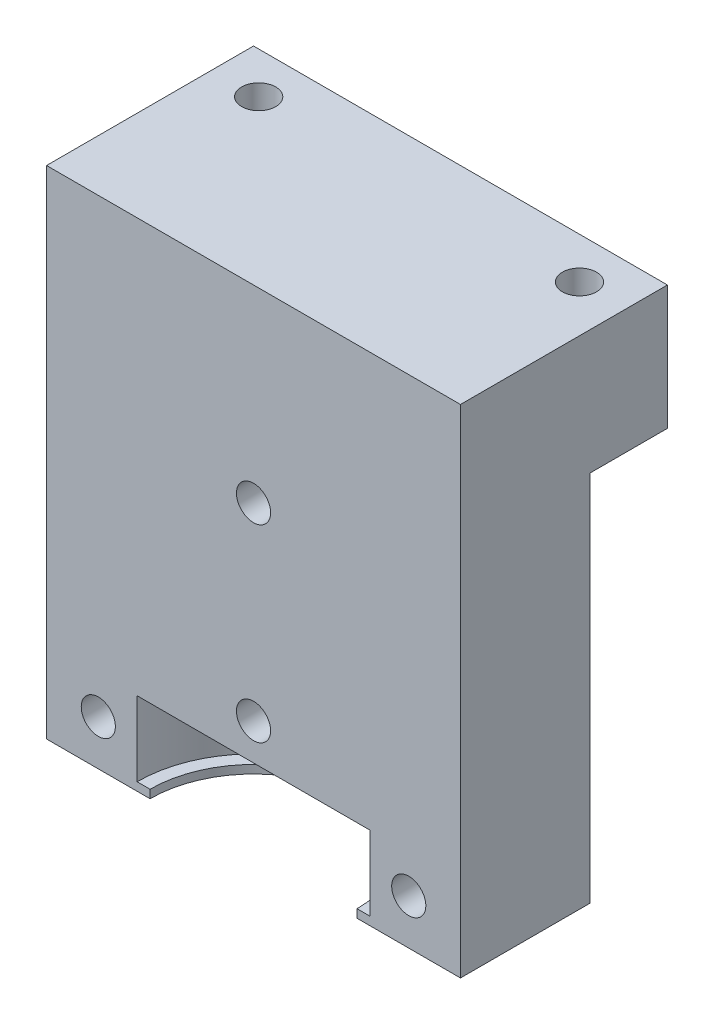
ISO-10303-21;
HEADER;
FILE_DESCRIPTION(('STEP AP214'),'2;1');
FILE_NAME('part.step','',(''),(''),'','','');
FILE_SCHEMA(('AUTOMOTIVE_DESIGN { 1 0 10303 214 1 1 1 1 }'));
ENDSEC;
DATA;
#1=APPLICATION_CONTEXT('core data for automotive mechanical design processes');
#2=APPLICATION_PROTOCOL_DEFINITION('international standard','automotive_design',2000,#1);
#3=PRODUCT_CONTEXT('',#1,'mechanical');
#4=PRODUCT('Part','Part','',(#3));
#5=PRODUCT_RELATED_PRODUCT_CATEGORY('part','',(#4));
#6=PRODUCT_DEFINITION_FORMATION('','',#4);
#7=PRODUCT_DEFINITION_CONTEXT('part definition',#1,'design');
#8=PRODUCT_DEFINITION('design','',#6,#7);
#9=PRODUCT_DEFINITION_SHAPE('','',#8);
#10=(LENGTH_UNIT() NAMED_UNIT(*) SI_UNIT(.MILLI.,.METRE.));
#11=(NAMED_UNIT(*) PLANE_ANGLE_UNIT() SI_UNIT($,.RADIAN.));
#12=(NAMED_UNIT(*) SI_UNIT($,.STERADIAN.) SOLID_ANGLE_UNIT());
#13=UNCERTAINTY_MEASURE_WITH_UNIT(LENGTH_MEASURE(1.E-05),#10,'distance_accuracy_value','');
#14=(GEOMETRIC_REPRESENTATION_CONTEXT(3) GLOBAL_UNCERTAINTY_ASSIGNED_CONTEXT((#13)) GLOBAL_UNIT_ASSIGNED_CONTEXT((#10,
#11,#12)) REPRESENTATION_CONTEXT('',''));
#15=CARTESIAN_POINT('',(0.,0.,0.));
#16=DIRECTION('',(0.,0.,1.));
#17=DIRECTION('',(1.,0.,0.));
#18=AXIS2_PLACEMENT_3D('',#15,#16,#17);
#19=CARTESIAN_POINT('',(20.,-48.,-20.));
#20=DIRECTION('',(0.,0.,-1.));
#21=DIRECTION('',(-1.,0.,0.));
#22=AXIS2_PLACEMENT_3D('',#19,#20,#21);
#23=PLANE('',#22);
#24=DIRECTION('',(0.,1.,0.));
#25=VECTOR('',#24,1.);
#26=CARTESIAN_POINT('',(20.,-48.,-20.));
#27=LINE('',#26,#25);
#28=CARTESIAN_POINT('',(20.,-12.,-20.));
#29=VERTEX_POINT('',#28);
#30=CARTESIAN_POINT('',(20.,0.,-20.));
#31=VERTEX_POINT('',#30);
#32=EDGE_CURVE('E132',#29,#31,#27,.T.);
#33=ORIENTED_EDGE('',*,*,#32,.F.);
#34=DIRECTION('',(1.,0.,0.));
#35=VECTOR('',#34,1.);
#36=CARTESIAN_POINT('',(-20.,-12.,-20.));
#37=LINE('',#36,#35);
#38=CARTESIAN_POINT('',(-20.,-12.,-20.));
#39=VERTEX_POINT('',#38);
#40=EDGE_CURVE('E119',#39,#29,#37,.T.);
#41=ORIENTED_EDGE('',*,*,#40,.F.);
#42=DIRECTION('',(0.,1.,0.));
#43=VECTOR('',#42,1.);
#44=CARTESIAN_POINT('',(-20.,-48.,-20.));
#45=LINE('',#44,#43);
#46=CARTESIAN_POINT('',(-20.,0.,-20.));
#47=VERTEX_POINT('',#46);
#48=EDGE_CURVE('E130',#39,#47,#45,.T.);
#49=ORIENTED_EDGE('',*,*,#48,.T.);
#50=DIRECTION('',(-1.,0.,0.));
#51=VECTOR('',#50,1.);
#52=CARTESIAN_POINT('',(20.,0.,-20.));
#53=LINE('',#52,#51);
#54=EDGE_CURVE('E146',#31,#47,#53,.T.);
#55=ORIENTED_EDGE('',*,*,#54,.F.);
#56=EDGE_LOOP('',(#33,#41,#49,#55));
#57=FACE_BOUND('',#56,.T.);
#58=ADVANCED_FACE('F35',(#57),#23,.T.);
#59=CARTESIAN_POINT('',(15.5,0.,-16.));
#60=DIRECTION('',(0.,1.,0.));
#61=DIRECTION('',(0.,0.,1.));
#62=AXIS2_PLACEMENT_3D('',#59,#60,#61);
#63=CYLINDRICAL_SURFACE('',#62,1.64999999999999);
#64=CARTESIAN_POINT('',(15.5,0.,-16.));
#65=DIRECTION('',(0.,1.,0.));
#66=DIRECTION('',(0.,0.,1.));
#67=AXIS2_PLACEMENT_3D('',#64,#65,#66);
#68=CIRCLE('',#67,1.64999999999999);
#69=CARTESIAN_POINT('',(15.5,0.,-14.35));
#70=VERTEX_POINT('',#69);
#71=EDGE_CURVE('E213',#70,#70,#68,.T.);
#72=ORIENTED_EDGE('',*,*,#71,.T.);
#73=EDGE_LOOP('',(#72));
#74=FACE_BOUND('',#73,.T.);
#75=CARTESIAN_POINT('',(15.5,-12.,-16.));
#76=DIRECTION('',(0.,-1.,0.));
#77=DIRECTION('',(0.,0.,-1.));
#78=AXIS2_PLACEMENT_3D('',#75,#76,#77);
#79=CIRCLE('',#78,1.64999999999999);
#80=CARTESIAN_POINT('',(15.5,-12.,-17.65));
#81=VERTEX_POINT('',#80);
#82=EDGE_CURVE('E172',#81,#81,#79,.F.);
#83=ORIENTED_EDGE('',*,*,#82,.F.);
#84=EDGE_LOOP('',(#83));
#85=FACE_BOUND('',#84,.T.);
#86=ADVANCED_FACE('F266',(#74,#85),#63,.F.);
#87=CARTESIAN_POINT('',(-15.5,0.,-16.));
#88=DIRECTION('',(0.,1.,0.));
#89=DIRECTION('',(0.,0.,1.));
#90=AXIS2_PLACEMENT_3D('',#87,#88,#89);
#91=CYLINDRICAL_SURFACE('',#90,1.64999999999999);
#92=CARTESIAN_POINT('',(-15.5,0.,-16.));
#93=DIRECTION('',(0.,1.,0.));
#94=DIRECTION('',(0.,0.,1.));
#95=AXIS2_PLACEMENT_3D('',#92,#93,#94);
#96=CIRCLE('',#95,1.64999999999999);
#97=CARTESIAN_POINT('',(-15.5,0.,-14.35));
#98=VERTEX_POINT('',#97);
#99=EDGE_CURVE('E209',#98,#98,#96,.T.);
#100=ORIENTED_EDGE('',*,*,#99,.T.);
#101=EDGE_LOOP('',(#100));
#102=FACE_BOUND('',#101,.T.);
#103=CARTESIAN_POINT('',(-15.5,-12.,-16.));
#104=DIRECTION('',(0.,-1.,0.));
#105=DIRECTION('',(0.,0.,-1.));
#106=AXIS2_PLACEMENT_3D('',#103,#104,#105);
#107=CIRCLE('',#106,1.64999999999999);
#108=CARTESIAN_POINT('',(-15.5,-12.,-17.65));
#109=VERTEX_POINT('',#108);
#110=EDGE_CURVE('E39',#109,#109,#107,.F.);
#111=ORIENTED_EDGE('',*,*,#110,.F.);
#112=EDGE_LOOP('',(#111));
#113=FACE_BOUND('',#112,.T.);
#114=ADVANCED_FACE('F271',(#102,#113),#91,.F.);
#115=CARTESIAN_POINT('',(-20.,-48.,0.));
#116=DIRECTION('',(0.,0.,-1.));
#117=DIRECTION('',(-1.,0.,0.));
#118=AXIS2_PLACEMENT_3D('',#115,#116,#117);
#119=PLANE('',#118);
#120=CARTESIAN_POINT('',(-15.,-43.628125,0.));
#121=DIRECTION('',(0.,0.,-1.));
#122=DIRECTION('',(-1.,0.,0.));
#123=AXIS2_PLACEMENT_3D('',#120,#121,#122);
#124=CIRCLE('',#123,1.65);
#125=CARTESIAN_POINT('',(-16.65,-43.628125,0.));
#126=VERTEX_POINT('',#125);
#127=EDGE_CURVE('E175',#126,#126,#124,.T.);
#128=ORIENTED_EDGE('',*,*,#127,.T.);
#129=EDGE_LOOP('',(#128));
#130=FACE_BOUND('',#129,.T.);
#131=CARTESIAN_POINT('',(15.,-43.628125,0.));
#132=DIRECTION('',(0.,0.,-1.));
#133=DIRECTION('',(-1.,0.,0.));
#134=AXIS2_PLACEMENT_3D('',#131,#132,#133);
#135=CIRCLE('',#134,1.65);
#136=CARTESIAN_POINT('',(13.35,-43.628125,0.));
#137=VERTEX_POINT('',#136);
#138=EDGE_CURVE('E178',#137,#137,#135,.T.);
#139=ORIENTED_EDGE('',*,*,#138,.T.);
#140=EDGE_LOOP('',(#139));
#141=FACE_BOUND('',#140,.T.);
#142=CARTESIAN_POINT('',(0.,-36.484375,0.));
#143=DIRECTION('',(0.,0.,-1.));
#144=DIRECTION('',(-1.,0.,0.));
#145=AXIS2_PLACEMENT_3D('',#142,#143,#144);
#146=CIRCLE('',#145,1.65);
#147=CARTESIAN_POINT('',(-1.65,-36.484375,0.));
#148=VERTEX_POINT('',#147);
#149=EDGE_CURVE('E181',#148,#148,#146,.T.);
#150=ORIENTED_EDGE('',*,*,#149,.T.);
#151=EDGE_LOOP('',(#150));
#152=FACE_BOUND('',#151,.T.);
#153=CARTESIAN_POINT('',(0.,-18.2421875,0.));
#154=DIRECTION('',(0.,0.,-1.));
#155=DIRECTION('',(-1.,0.,0.));
#156=AXIS2_PLACEMENT_3D('',#153,#154,#155);
#157=CIRCLE('',#156,1.65);
#158=CARTESIAN_POINT('',(-1.65,-18.2421875,0.));
#159=VERTEX_POINT('',#158);
#160=EDGE_CURVE('E184',#159,#159,#157,.T.);
#161=ORIENTED_EDGE('',*,*,#160,.T.);
#162=EDGE_LOOP('',(#161));
#163=FACE_BOUND('',#162,.T.);
#164=DIRECTION('',(1.,0.,0.));
#165=VECTOR('',#164,1.);
#166=CARTESIAN_POINT('',(-20.,-47.2,0.));
#167=LINE('',#166,#165);
#168=CARTESIAN_POINT('',(10.,-47.2,0.));
#169=VERTEX_POINT('',#168);
#170=CARTESIAN_POINT('',(11.25,-47.2,0.));
#171=VERTEX_POINT('',#170);
#172=EDGE_CURVE('E44',#169,#171,#167,.T.);
#173=ORIENTED_EDGE('',*,*,#172,.F.);
#174=DIRECTION('',(0.,-1.,0.));
#175=VECTOR('',#174,1.);
#176=CARTESIAN_POINT('',(10.,0.001000000000001,0.));
#177=LINE('',#176,#175);
#178=CARTESIAN_POINT('',(10.,-48.,0.));
#179=VERTEX_POINT('',#178);
#180=EDGE_CURVE('E60',#179,#169,#177,.F.);
#181=ORIENTED_EDGE('',*,*,#180,.F.);
#182=DIRECTION('',(-1.,0.,0.));
#183=VECTOR('',#182,1.);
#184=CARTESIAN_POINT('',(-20.,-48.,0.));
#185=LINE('',#184,#183);
#186=CARTESIAN_POINT('',(20.,-48.,0.));
#187=VERTEX_POINT('',#186);
#188=EDGE_CURVE('E201',#187,#179,#185,.T.);
#189=ORIENTED_EDGE('',*,*,#188,.F.);
#190=DIRECTION('',(0.,1.,0.));
#191=VECTOR('',#190,1.);
#192=CARTESIAN_POINT('',(20.,-48.,0.));
#193=LINE('',#192,#191);
#194=CARTESIAN_POINT('',(20.,0.,0.));
#195=VERTEX_POINT('',#194);
#196=EDGE_CURVE('E204',#187,#195,#193,.T.);
#197=ORIENTED_EDGE('',*,*,#196,.T.);
#198=DIRECTION('',(-1.,0.,0.));
#199=VECTOR('',#198,1.);
#200=CARTESIAN_POINT('',(-20.,0.,0.));
#201=LINE('',#200,#199);
#202=CARTESIAN_POINT('',(-20.,0.,0.));
#203=VERTEX_POINT('',#202);
#204=EDGE_CURVE('E200',#195,#203,#201,.T.);
#205=ORIENTED_EDGE('',*,*,#204,.T.);
#206=DIRECTION('',(0.,1.,0.));
#207=VECTOR('',#206,1.);
#208=CARTESIAN_POINT('',(-20.,-48.,0.));
#209=LINE('',#208,#207);
#210=CARTESIAN_POINT('',(-20.,-48.,0.));
#211=VERTEX_POINT('',#210);
#212=EDGE_CURVE('E207',#211,#203,#209,.T.);
#213=ORIENTED_EDGE('',*,*,#212,.F.);
#214=CARTESIAN_POINT('',(-10.,-48.,0.));
#215=VERTEX_POINT('',#214);
#216=EDGE_CURVE('E205',#215,#211,#185,.T.);
#217=ORIENTED_EDGE('',*,*,#216,.F.);
#218=DIRECTION('',(0.,-1.,0.));
#219=VECTOR('',#218,1.);
#220=CARTESIAN_POINT('',(-10.,0.001000000000001,0.));
#221=LINE('',#220,#219);
#222=CARTESIAN_POINT('',(-10.,-47.2,0.));
#223=VERTEX_POINT('',#222);
#224=EDGE_CURVE('E187',#223,#215,#221,.T.);
#225=ORIENTED_EDGE('',*,*,#224,.F.);
#226=CARTESIAN_POINT('',(-11.25,-47.2,0.));
#227=VERTEX_POINT('',#226);
#228=EDGE_CURVE('E11',#227,#223,#167,.T.);
#229=ORIENTED_EDGE('',*,*,#228,.F.);
#230=DIRECTION('',(0.,1.,0.));
#231=VECTOR('',#230,1.);
#232=CARTESIAN_POINT('',(-11.25,0.,0.));
#233=LINE('',#232,#231);
#234=CARTESIAN_POINT('',(-11.25,-40.,0.));
#235=VERTEX_POINT('',#234);
#236=EDGE_CURVE('E151',#235,#227,#233,.F.);
#237=ORIENTED_EDGE('',*,*,#236,.F.);
#238=DIRECTION('',(-1.,0.,0.));
#239=VECTOR('',#238,1.);
#240=CARTESIAN_POINT('',(-20.,-40.,0.));
#241=LINE('',#240,#239);
#242=CARTESIAN_POINT('',(11.25,-40.,0.));
#243=VERTEX_POINT('',#242);
#244=EDGE_CURVE('E139',#243,#235,#241,.T.);
#245=ORIENTED_EDGE('',*,*,#244,.F.);
#246=DIRECTION('',(0.,1.,0.));
#247=VECTOR('',#246,1.);
#248=CARTESIAN_POINT('',(11.25,0.,0.));
#249=LINE('',#248,#247);
#250=EDGE_CURVE('E141',#171,#243,#249,.T.);
#251=ORIENTED_EDGE('',*,*,#250,.F.);
#252=EDGE_LOOP('',(#173,#181,#189,#197,#205,#213,#217,#225,#229,#237,#245,#251));
#253=FACE_BOUND('',#252,.T.);
#254=ADVANCED_FACE('F242',(#130,#141,#152,#163,#253),#119,.F.);
#255=CARTESIAN_POINT('',(0.,0.,0.));
#256=DIRECTION('',(0.,-1.,0.));
#257=DIRECTION('',(0.,0.,-1.));
#258=AXIS2_PLACEMENT_3D('',#255,#256,#257);
#259=PLANE('',#258);
#260=ORIENTED_EDGE('',*,*,#99,.F.);
#261=EDGE_LOOP('',(#260));
#262=FACE_BOUND('',#261,.T.);
#263=DIRECTION('',(0.,0.,1.));
#264=VECTOR('',#263,1.);
#265=CARTESIAN_POINT('',(-20.,0.,-20.));
#266=LINE('',#265,#264);
#267=EDGE_CURVE('E137',#47,#203,#266,.T.);
#268=ORIENTED_EDGE('',*,*,#267,.T.);
#269=ORIENTED_EDGE('',*,*,#204,.F.);
#270=DIRECTION('',(0.,0.,-1.));
#271=VECTOR('',#270,1.);
#272=CARTESIAN_POINT('',(20.,0.,-20.));
#273=LINE('',#272,#271);
#274=EDGE_CURVE('E220',#195,#31,#273,.T.);
#275=ORIENTED_EDGE('',*,*,#274,.T.);
#276=ORIENTED_EDGE('',*,*,#54,.T.);
#277=EDGE_LOOP('',(#268,#269,#275,#276));
#278=FACE_BOUND('',#277,.T.);
#279=ORIENTED_EDGE('',*,*,#71,.F.);
#280=EDGE_LOOP('',(#279));
#281=FACE_BOUND('',#280,.T.);
#282=ADVANCED_FACE('F225',(#262,#278,#281),#259,.F.);
#283=CARTESIAN_POINT('',(-20.,-48.,-20.));
#284=DIRECTION('',(-1.,0.,0.));
#285=DIRECTION('',(0.,0.,1.));
#286=AXIS2_PLACEMENT_3D('',#283,#284,#285);
#287=PLANE('',#286);
#288=DIRECTION('',(0.,-1.,0.));
#289=VECTOR('',#288,1.);
#290=CARTESIAN_POINT('',(-20.,-12.,-12.5));
#291=LINE('',#290,#289);
#292=CARTESIAN_POINT('',(-20.,-12.,-12.5));
#293=VERTEX_POINT('',#292);
#294=CARTESIAN_POINT('',(-20.,-48.,-12.5));
#295=VERTEX_POINT('',#294);
#296=EDGE_CURVE('E155',#293,#295,#291,.T.);
#297=ORIENTED_EDGE('',*,*,#296,.T.);
#298=DIRECTION('',(0.,0.,1.));
#299=VECTOR('',#298,1.);
#300=CARTESIAN_POINT('',(-20.,-48.,-20.));
#301=LINE('',#300,#299);
#302=EDGE_CURVE('E216',#295,#211,#301,.T.);
#303=ORIENTED_EDGE('',*,*,#302,.T.);
#304=ORIENTED_EDGE('',*,*,#212,.T.);
#305=ORIENTED_EDGE('',*,*,#267,.F.);
#306=ORIENTED_EDGE('',*,*,#48,.F.);
#307=DIRECTION('',(0.,0.,-1.));
#308=VECTOR('',#307,1.);
#309=CARTESIAN_POINT('',(-20.,-12.,-12.5));
#310=LINE('',#309,#308);
#311=EDGE_CURVE('E115',#293,#39,#310,.T.);
#312=ORIENTED_EDGE('',*,*,#311,.F.);
#313=EDGE_LOOP('',(#297,#303,#304,#305,#306,#312));
#314=FACE_BOUND('',#313,.T.);
#315=ADVANCED_FACE('F37',(#314),#287,.T.);
#316=CARTESIAN_POINT('',(20.,-48.,-20.));
#317=DIRECTION('',(1.,0.,0.));
#318=DIRECTION('',(0.,0.,-1.));
#319=AXIS2_PLACEMENT_3D('',#316,#317,#318);
#320=PLANE('',#319);
#321=DIRECTION('',(0.,-1.,0.));
#322=VECTOR('',#321,1.);
#323=CARTESIAN_POINT('',(20.,-12.,-12.5));
#324=LINE('',#323,#322);
#325=CARTESIAN_POINT('',(20.,-12.,-12.5));
#326=VERTEX_POINT('',#325);
#327=CARTESIAN_POINT('',(20.,-48.,-12.5));
#328=VERTEX_POINT('',#327);
#329=EDGE_CURVE('E52',#326,#328,#324,.T.);
#330=ORIENTED_EDGE('',*,*,#329,.F.);
#331=DIRECTION('',(0.,0.,1.));
#332=VECTOR('',#331,1.);
#333=CARTESIAN_POINT('',(20.,-12.,-12.5));
#334=LINE('',#333,#332);
#335=EDGE_CURVE('E133',#29,#326,#334,.T.);
#336=ORIENTED_EDGE('',*,*,#335,.F.);
#337=ORIENTED_EDGE('',*,*,#32,.T.);
#338=ORIENTED_EDGE('',*,*,#274,.F.);
#339=ORIENTED_EDGE('',*,*,#196,.F.);
#340=DIRECTION('',(0.,0.,-1.));
#341=VECTOR('',#340,1.);
#342=CARTESIAN_POINT('',(20.,-48.,-20.));
#343=LINE('',#342,#341);
#344=EDGE_CURVE('E143',#187,#328,#343,.T.);
#345=ORIENTED_EDGE('',*,*,#344,.T.);
#346=EDGE_LOOP('',(#330,#336,#337,#338,#339,#345));
#347=FACE_BOUND('',#346,.T.);
#348=ADVANCED_FACE('F231',(#347),#320,.T.);
#349=CARTESIAN_POINT('',(0.,-48.,0.));
#350=DIRECTION('',(0.,-1.,0.));
#351=DIRECTION('',(0.,0.,-1.));
#352=AXIS2_PLACEMENT_3D('',#349,#350,#351);
#353=PLANE('',#352);
#354=DIRECTION('',(-1.,0.,0.));
#355=VECTOR('',#354,1.);
#356=CARTESIAN_POINT('',(-20.,-48.,-12.5));
#357=LINE('',#356,#355);
#358=EDGE_CURVE('E125',#328,#295,#357,.T.);
#359=ORIENTED_EDGE('',*,*,#358,.F.);
#360=ORIENTED_EDGE('',*,*,#344,.F.);
#361=ORIENTED_EDGE('',*,*,#188,.T.);
#362=CARTESIAN_POINT('',(0.,-48.,0.));
#363=DIRECTION('',(0.,-1.,0.));
#364=DIRECTION('',(0.,0.,-1.));
#365=AXIS2_PLACEMENT_3D('',#362,#363,#364);
#366=CIRCLE('',#365,10.);
#367=EDGE_CURVE('E190',#215,#179,#366,.T.);
#368=ORIENTED_EDGE('',*,*,#367,.F.);
#369=ORIENTED_EDGE('',*,*,#216,.T.);
#370=ORIENTED_EDGE('',*,*,#302,.F.);
#371=EDGE_LOOP('',(#359,#360,#361,#368,#369,#370));
#372=FACE_BOUND('',#371,.T.);
#373=ADVANCED_FACE('F237',(#372),#353,.T.);
#374=CARTESIAN_POINT('',(0.,-47.2,0.));
#375=DIRECTION('',(0.,1.,0.));
#376=DIRECTION('',(-1.,0.,0.));
#377=AXIS2_PLACEMENT_3D('',#374,#375,#376);
#378=PLANE('',#377);
#379=CARTESIAN_POINT('',(0.,-47.2,0.));
#380=DIRECTION('',(0.,1.,0.));
#381=DIRECTION('',(-1.,0.,0.));
#382=AXIS2_PLACEMENT_3D('',#379,#380,#381);
#383=CIRCLE('',#382,10.);
#384=EDGE_CURVE('E192',#223,#169,#383,.F.);
#385=ORIENTED_EDGE('',*,*,#384,.T.);
#386=ORIENTED_EDGE('',*,*,#172,.T.);
#387=CARTESIAN_POINT('',(0.,-47.2,0.));
#388=DIRECTION('',(0.,1.,0.));
#389=DIRECTION('',(-1.,0.,0.));
#390=AXIS2_PLACEMENT_3D('',#387,#388,#389);
#391=CIRCLE('',#390,11.25);
#392=EDGE_CURVE('E197',#171,#227,#391,.T.);
#393=ORIENTED_EDGE('',*,*,#392,.T.);
#394=ORIENTED_EDGE('',*,*,#228,.T.);
#395=EDGE_LOOP('',(#385,#386,#393,#394));
#396=FACE_BOUND('',#395,.T.);
#397=ADVANCED_FACE('F247',(#396),#378,.T.);
#398=CARTESIAN_POINT('',(0.,0.,0.));
#399=DIRECTION('',(0.,1.,0.));
#400=DIRECTION('',(-1.,0.,0.));
#401=AXIS2_PLACEMENT_3D('',#398,#399,#400);
#402=CYLINDRICAL_SURFACE('',#401,11.25);
#403=ORIENTED_EDGE('',*,*,#236,.T.);
#404=ORIENTED_EDGE('',*,*,#392,.F.);
#405=ORIENTED_EDGE('',*,*,#250,.T.);
#406=CARTESIAN_POINT('',(0.,-40.,0.));
#407=DIRECTION('',(0.,1.,0.));
#408=DIRECTION('',(-1.,0.,0.));
#409=AXIS2_PLACEMENT_3D('',#406,#407,#408);
#410=CIRCLE('',#409,11.25);
#411=EDGE_CURVE('E194',#243,#235,#410,.T.);
#412=ORIENTED_EDGE('',*,*,#411,.T.);
#413=EDGE_LOOP('',(#403,#404,#405,#412));
#414=FACE_BOUND('',#413,.T.);
#415=ADVANCED_FACE('F251',(#414),#402,.F.);
#416=CARTESIAN_POINT('',(0.,-40.,0.));
#417=DIRECTION('',(0.,-1.,0.));
#418=DIRECTION('',(1.,0.,0.));
#419=AXIS2_PLACEMENT_3D('',#416,#417,#418);
#420=PLANE('',#419);
#421=ORIENTED_EDGE('',*,*,#244,.T.);
#422=ORIENTED_EDGE('',*,*,#411,.F.);
#423=EDGE_LOOP('',(#421,#422));
#424=FACE_BOUND('',#423,.T.);
#425=ADVANCED_FACE('F254',(#424),#420,.T.);
#426=CARTESIAN_POINT('',(0.,0.001000000000001,0.));
#427=DIRECTION('',(0.,-1.,0.));
#428=DIRECTION('',(0.,0.,-1.));
#429=AXIS2_PLACEMENT_3D('',#426,#427,#428);
#430=CYLINDRICAL_SURFACE('',#429,10.);
#431=ORIENTED_EDGE('',*,*,#180,.T.);
#432=ORIENTED_EDGE('',*,*,#384,.F.);
#433=ORIENTED_EDGE('',*,*,#224,.T.);
#434=ORIENTED_EDGE('',*,*,#367,.T.);
#435=EDGE_LOOP('',(#431,#432,#433,#434));
#436=FACE_BOUND('',#435,.T.);
#437=ADVANCED_FACE('F256',(#436),#430,.F.);
#438=CARTESIAN_POINT('',(0.,-18.2421875,-20.));
#439=DIRECTION('',(0.,0.,-1.));
#440=DIRECTION('',(-1.,0.,0.));
#441=AXIS2_PLACEMENT_3D('',#438,#439,#440);
#442=CYLINDRICAL_SURFACE('',#441,1.65);
#443=CARTESIAN_POINT('',(0.,-18.2421875,-12.5));
#444=DIRECTION('',(0.,0.,1.));
#445=DIRECTION('',(1.,0.,0.));
#446=AXIS2_PLACEMENT_3D('',#443,#444,#445);
#447=CIRCLE('',#446,1.65);
#448=CARTESIAN_POINT('',(1.65,-18.2421875,-12.5));
#449=VERTEX_POINT('',#448);
#450=EDGE_CURVE('E169',#449,#449,#447,.F.);
#451=ORIENTED_EDGE('',*,*,#450,.T.);
#452=EDGE_LOOP('',(#451));
#453=FACE_BOUND('',#452,.T.);
#454=ORIENTED_EDGE('',*,*,#160,.F.);
#455=EDGE_LOOP('',(#454));
#456=FACE_BOUND('',#455,.T.);
#457=ADVANCED_FACE('F262',(#453,#456),#442,.F.);
#458=CARTESIAN_POINT('',(0.,-36.484375,-20.));
#459=DIRECTION('',(0.,0.,-1.));
#460=DIRECTION('',(-1.,0.,0.));
#461=AXIS2_PLACEMENT_3D('',#458,#459,#460);
#462=CYLINDRICAL_SURFACE('',#461,1.65);
#463=CARTESIAN_POINT('',(0.,-36.484375,-12.5));
#464=DIRECTION('',(0.,0.,1.));
#465=DIRECTION('',(1.,0.,0.));
#466=AXIS2_PLACEMENT_3D('',#463,#464,#465);
#467=CIRCLE('',#466,1.65);
#468=CARTESIAN_POINT('',(1.65,-36.484375,-12.5));
#469=VERTEX_POINT('',#468);
#470=EDGE_CURVE('E159',#469,#469,#467,.F.);
#471=ORIENTED_EDGE('',*,*,#470,.T.);
#472=EDGE_LOOP('',(#471));
#473=FACE_BOUND('',#472,.T.);
#474=ORIENTED_EDGE('',*,*,#149,.F.);
#475=EDGE_LOOP('',(#474));
#476=FACE_BOUND('',#475,.T.);
#477=ADVANCED_FACE('F314',(#473,#476),#462,.F.);
#478=CARTESIAN_POINT('',(15.,-43.628125,-20.));
#479=DIRECTION('',(0.,0.,-1.));
#480=DIRECTION('',(-1.,0.,0.));
#481=AXIS2_PLACEMENT_3D('',#478,#479,#480);
#482=CYLINDRICAL_SURFACE('',#481,1.65);
#483=CARTESIAN_POINT('',(15.,-43.628125,-12.5));
#484=DIRECTION('',(0.,0.,1.));
#485=DIRECTION('',(1.,0.,0.));
#486=AXIS2_PLACEMENT_3D('',#483,#484,#485);
#487=CIRCLE('',#486,1.65);
#488=CARTESIAN_POINT('',(16.65,-43.628125,-12.5));
#489=VERTEX_POINT('',#488);
#490=EDGE_CURVE('E154',#489,#489,#487,.F.);
#491=ORIENTED_EDGE('',*,*,#490,.T.);
#492=EDGE_LOOP('',(#491));
#493=FACE_BOUND('',#492,.T.);
#494=ORIENTED_EDGE('',*,*,#138,.F.);
#495=EDGE_LOOP('',(#494));
#496=FACE_BOUND('',#495,.T.);
#497=ADVANCED_FACE('F309',(#493,#496),#482,.F.);
#498=CARTESIAN_POINT('',(-15.,-43.628125,-20.));
#499=DIRECTION('',(0.,0.,-1.));
#500=DIRECTION('',(-1.,0.,0.));
#501=AXIS2_PLACEMENT_3D('',#498,#499,#500);
#502=CYLINDRICAL_SURFACE('',#501,1.65);
#503=CARTESIAN_POINT('',(-15.,-43.628125,-12.5));
#504=DIRECTION('',(0.,0.,1.));
#505=DIRECTION('',(1.,0.,0.));
#506=AXIS2_PLACEMENT_3D('',#503,#504,#505);
#507=CIRCLE('',#506,1.65);
#508=CARTESIAN_POINT('',(-13.35,-43.628125,-12.5));
#509=VERTEX_POINT('',#508);
#510=EDGE_CURVE('E152',#509,#509,#507,.F.);
#511=ORIENTED_EDGE('',*,*,#510,.T.);
#512=EDGE_LOOP('',(#511));
#513=FACE_BOUND('',#512,.T.);
#514=ORIENTED_EDGE('',*,*,#127,.F.);
#515=EDGE_LOOP('',(#514));
#516=FACE_BOUND('',#515,.T.);
#517=ADVANCED_FACE('F299',(#513,#516),#502,.F.);
#518=CARTESIAN_POINT('',(0.,-12.,0.));
#519=DIRECTION('',(0.,-1.,0.));
#520=DIRECTION('',(0.,0.,-1.));
#521=AXIS2_PLACEMENT_3D('',#518,#519,#520);
#522=PLANE('',#521);
#523=ORIENTED_EDGE('',*,*,#311,.T.);
#524=ORIENTED_EDGE('',*,*,#40,.T.);
#525=ORIENTED_EDGE('',*,*,#335,.T.);
#526=DIRECTION('',(-1.,0.,0.));
#527=VECTOR('',#526,1.);
#528=CARTESIAN_POINT('',(-20.,-12.,-12.5));
#529=LINE('',#528,#527);
#530=EDGE_CURVE('E121',#326,#293,#529,.T.);
#531=ORIENTED_EDGE('',*,*,#530,.T.);
#532=EDGE_LOOP('',(#523,#524,#525,#531));
#533=FACE_BOUND('',#532,.T.);
#534=ORIENTED_EDGE('',*,*,#110,.T.);
#535=EDGE_LOOP('',(#534));
#536=FACE_BOUND('',#535,.T.);
#537=ORIENTED_EDGE('',*,*,#82,.T.);
#538=EDGE_LOOP('',(#537));
#539=FACE_BOUND('',#538,.T.);
#540=ADVANCED_FACE('F117',(#533,#536,#539),#522,.T.);
#541=CARTESIAN_POINT('',(-20.,-12.,-12.5));
#542=DIRECTION('',(0.,0.,1.));
#543=DIRECTION('',(1.,0.,0.));
#544=AXIS2_PLACEMENT_3D('',#541,#542,#543);
#545=PLANE('',#544);
#546=ORIENTED_EDGE('',*,*,#470,.F.);
#547=EDGE_LOOP('',(#546));
#548=FACE_BOUND('',#547,.T.);
#549=ORIENTED_EDGE('',*,*,#510,.F.);
#550=EDGE_LOOP('',(#549));
#551=FACE_BOUND('',#550,.T.);
#552=ORIENTED_EDGE('',*,*,#358,.T.);
#553=ORIENTED_EDGE('',*,*,#296,.F.);
#554=ORIENTED_EDGE('',*,*,#530,.F.);
#555=ORIENTED_EDGE('',*,*,#329,.T.);
#556=EDGE_LOOP('',(#552,#553,#554,#555));
#557=FACE_BOUND('',#556,.T.);
#558=ORIENTED_EDGE('',*,*,#490,.F.);
#559=EDGE_LOOP('',(#558));
#560=FACE_BOUND('',#559,.T.);
#561=ORIENTED_EDGE('',*,*,#450,.F.);
#562=EDGE_LOOP('',(#561));
#563=FACE_BOUND('',#562,.T.);
#564=ADVANCED_FACE('F234',(#548,#551,#557,#560,#563),#545,.F.);
#565=CLOSED_SHELL('',(#58,#86,#114,#254,#282,#315,#348,#373,#397,#415,#425,#437,#457,#477,#497,
#517,#540,#564));
#566=MANIFOLD_SOLID_BREP('B2',#565);
#567=ADVANCED_BREP_SHAPE_REPRESENTATION('',(#18,#566),#14);
#568=SHAPE_DEFINITION_REPRESENTATION(#9,#567);
ENDSEC;
END-ISO-10303-21;
